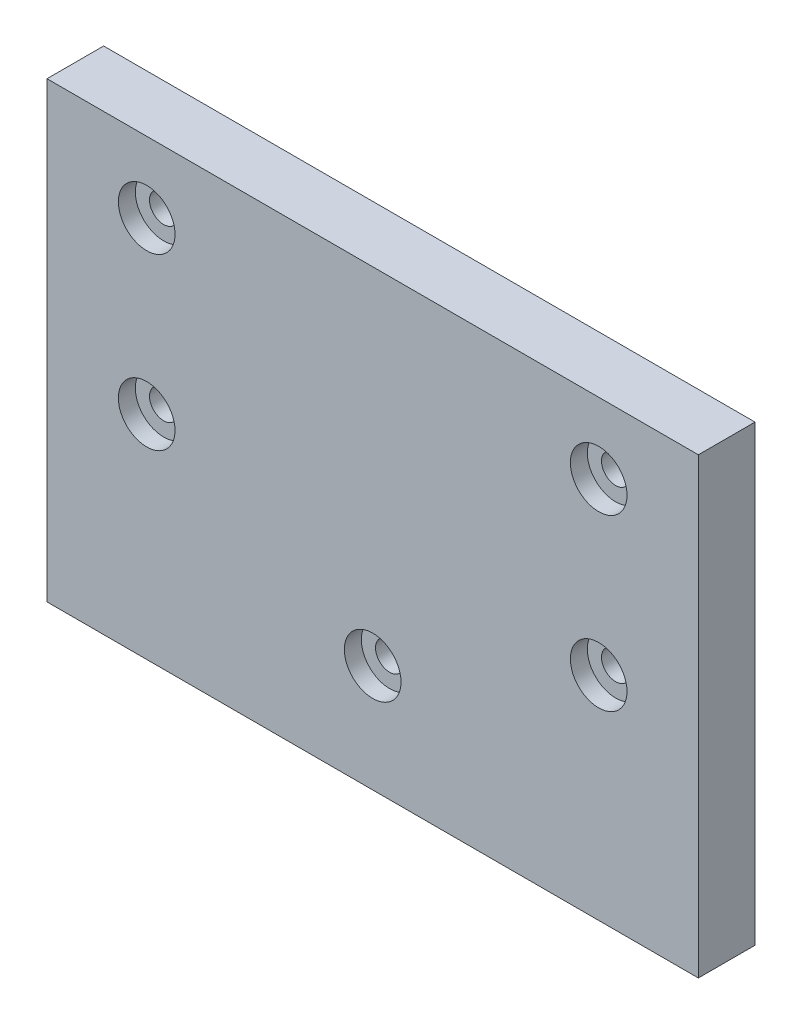
ISO-10303-21;
HEADER;
FILE_DESCRIPTION(('STEP AP214'),'2;1');
FILE_NAME('part.step','',(''),(''),'','','');
FILE_SCHEMA(('AUTOMOTIVE_DESIGN { 1 0 10303 214 1 1 1 1 }'));
ENDSEC;
DATA;
#1=APPLICATION_CONTEXT('core data for automotive mechanical design processes');
#2=APPLICATION_PROTOCOL_DEFINITION('international standard','automotive_design',2000,#1);
#3=PRODUCT_CONTEXT('',#1,'mechanical');
#4=PRODUCT('Part','Part','',(#3));
#5=PRODUCT_RELATED_PRODUCT_CATEGORY('part','',(#4));
#6=PRODUCT_DEFINITION_FORMATION('','',#4);
#7=PRODUCT_DEFINITION_CONTEXT('part definition',#1,'design');
#8=PRODUCT_DEFINITION('design','',#6,#7);
#9=PRODUCT_DEFINITION_SHAPE('','',#8);
#10=(LENGTH_UNIT() NAMED_UNIT(*) SI_UNIT(.MILLI.,.METRE.));
#11=(NAMED_UNIT(*) PLANE_ANGLE_UNIT() SI_UNIT($,.RADIAN.));
#12=(NAMED_UNIT(*) SI_UNIT($,.STERADIAN.) SOLID_ANGLE_UNIT());
#13=UNCERTAINTY_MEASURE_WITH_UNIT(LENGTH_MEASURE(1.E-05),#10,'distance_accuracy_value','');
#14=(GEOMETRIC_REPRESENTATION_CONTEXT(3) GLOBAL_UNCERTAINTY_ASSIGNED_CONTEXT((#13)) GLOBAL_UNIT_ASSIGNED_CONTEXT((#10,
#11,#12)) REPRESENTATION_CONTEXT('',''));
#15=CARTESIAN_POINT('',(0.,0.,0.));
#16=DIRECTION('',(0.,0.,1.));
#17=DIRECTION('',(1.,0.,0.));
#18=AXIS2_PLACEMENT_3D('',#15,#16,#17);
#19=CARTESIAN_POINT('',(0.,-21.009684694307,0.));
#20=DIRECTION('',(0.,0.,1.));
#21=DIRECTION('',(1.,0.,0.));
#22=AXIS2_PLACEMENT_3D('',#19,#20,#21);
#23=CYLINDRICAL_SURFACE('',#22,2.5);
#24=CARTESIAN_POINT('',(0.,-21.009684694307,0.));
#25=DIRECTION('',(0.,0.,1.));
#26=DIRECTION('',(1.,0.,0.));
#27=AXIS2_PLACEMENT_3D('',#24,#25,#26);
#28=CIRCLE('',#27,2.5);
#29=CARTESIAN_POINT('',(2.5,-21.009684694307,0.));
#30=VERTEX_POINT('',#29);
#31=EDGE_CURVE('E216',#30,#30,#28,.T.);
#32=ORIENTED_EDGE('',*,*,#31,.F.);
#33=EDGE_LOOP('',(#32));
#34=FACE_BOUND('',#33,.T.);
#35=CARTESIAN_POINT('',(0.,-21.009684694307,7.));
#36=DIRECTION('',(0.,0.,1.));
#37=DIRECTION('',(1.,0.,0.));
#38=AXIS2_PLACEMENT_3D('',#35,#36,#37);
#39=CIRCLE('',#38,2.5);
#40=CARTESIAN_POINT('',(2.5,-21.009684694307,7.));
#41=VERTEX_POINT('',#40);
#42=EDGE_CURVE('E37',#41,#41,#39,.F.);
#43=ORIENTED_EDGE('',*,*,#42,.F.);
#44=EDGE_LOOP('',(#43));
#45=FACE_BOUND('',#44,.T.);
#46=ADVANCED_FACE('F33',(#34,#45),#23,.F.);
#47=CARTESIAN_POINT('',(39.9,-2.5,0.));
#48=DIRECTION('',(0.,0.,1.));
#49=DIRECTION('',(1.,0.,0.));
#50=AXIS2_PLACEMENT_3D('',#47,#48,#49);
#51=CYLINDRICAL_SURFACE('',#50,2.5);
#52=CARTESIAN_POINT('',(39.9,-2.5,0.));
#53=DIRECTION('',(0.,0.,1.));
#54=DIRECTION('',(1.,0.,0.));
#55=AXIS2_PLACEMENT_3D('',#52,#53,#54);
#56=CIRCLE('',#55,2.5);
#57=CARTESIAN_POINT('',(42.4,-2.5,0.));
#58=VERTEX_POINT('',#57);
#59=EDGE_CURVE('E11',#58,#58,#56,.T.);
#60=ORIENTED_EDGE('',*,*,#59,.F.);
#61=EDGE_LOOP('',(#60));
#62=FACE_BOUND('',#61,.T.);
#63=CARTESIAN_POINT('',(39.9,-2.5,7.));
#64=DIRECTION('',(0.,0.,1.));
#65=DIRECTION('',(1.,0.,0.));
#66=AXIS2_PLACEMENT_3D('',#63,#64,#65);
#67=CIRCLE('',#66,2.5);
#68=CARTESIAN_POINT('',(42.4,-2.5,7.));
#69=VERTEX_POINT('',#68);
#70=EDGE_CURVE('E126',#69,#69,#67,.F.);
#71=ORIENTED_EDGE('',*,*,#70,.F.);
#72=EDGE_LOOP('',(#71));
#73=FACE_BOUND('',#72,.T.);
#74=ADVANCED_FACE('F35',(#62,#73),#51,.F.);
#75=CARTESIAN_POINT('',(-39.9,-2.5,0.));
#76=DIRECTION('',(0.,0.,1.));
#77=DIRECTION('',(1.,0.,0.));
#78=AXIS2_PLACEMENT_3D('',#75,#76,#77);
#79=CYLINDRICAL_SURFACE('',#78,2.5);
#80=CARTESIAN_POINT('',(-39.9,-2.5,0.));
#81=DIRECTION('',(0.,0.,1.));
#82=DIRECTION('',(1.,0.,0.));
#83=AXIS2_PLACEMENT_3D('',#80,#81,#82);
#84=CIRCLE('',#83,2.5);
#85=CARTESIAN_POINT('',(-37.4,-2.5,0.));
#86=VERTEX_POINT('',#85);
#87=EDGE_CURVE('E43',#86,#86,#84,.T.);
#88=ORIENTED_EDGE('',*,*,#87,.F.);
#89=EDGE_LOOP('',(#88));
#90=FACE_BOUND('',#89,.T.);
#91=CARTESIAN_POINT('',(-39.9,-2.5,7.));
#92=DIRECTION('',(0.,0.,1.));
#93=DIRECTION('',(1.,0.,0.));
#94=AXIS2_PLACEMENT_3D('',#91,#92,#93);
#95=CIRCLE('',#94,2.5);
#96=CARTESIAN_POINT('',(-37.4,-2.5,7.));
#97=VERTEX_POINT('',#96);
#98=EDGE_CURVE('E123',#97,#97,#95,.F.);
#99=ORIENTED_EDGE('',*,*,#98,.F.);
#100=EDGE_LOOP('',(#99));
#101=FACE_BOUND('',#100,.T.);
#102=ADVANCED_FACE('F176',(#90,#101),#79,.F.);
#103=CARTESIAN_POINT('',(39.9,27.5,0.));
#104=DIRECTION('',(0.,0.,1.));
#105=DIRECTION('',(1.,0.,0.));
#106=AXIS2_PLACEMENT_3D('',#103,#104,#105);
#107=CYLINDRICAL_SURFACE('',#106,2.5);
#108=CARTESIAN_POINT('',(39.9,27.5,0.));
#109=DIRECTION('',(0.,0.,1.));
#110=DIRECTION('',(1.,0.,0.));
#111=AXIS2_PLACEMENT_3D('',#108,#109,#110);
#112=CIRCLE('',#111,2.5);
#113=CARTESIAN_POINT('',(42.4,27.5,0.));
#114=VERTEX_POINT('',#113);
#115=EDGE_CURVE('E118',#114,#114,#112,.T.);
#116=ORIENTED_EDGE('',*,*,#115,.F.);
#117=EDGE_LOOP('',(#116));
#118=FACE_BOUND('',#117,.T.);
#119=CARTESIAN_POINT('',(39.9,27.5,7.));
#120=DIRECTION('',(0.,0.,1.));
#121=DIRECTION('',(1.,0.,0.));
#122=AXIS2_PLACEMENT_3D('',#119,#120,#121);
#123=CIRCLE('',#122,2.5);
#124=CARTESIAN_POINT('',(42.4,27.5,7.));
#125=VERTEX_POINT('',#124);
#126=EDGE_CURVE('E120',#125,#125,#123,.F.);
#127=ORIENTED_EDGE('',*,*,#126,.F.);
#128=EDGE_LOOP('',(#127));
#129=FACE_BOUND('',#128,.T.);
#130=ADVANCED_FACE('F151',(#118,#129),#107,.F.);
#131=CARTESIAN_POINT('',(-39.9,27.5,0.));
#132=DIRECTION('',(0.,0.,1.));
#133=DIRECTION('',(1.,0.,0.));
#134=AXIS2_PLACEMENT_3D('',#131,#132,#133);
#135=CYLINDRICAL_SURFACE('',#134,2.5);
#136=CARTESIAN_POINT('',(-39.9,27.5,0.));
#137=DIRECTION('',(0.,0.,1.));
#138=DIRECTION('',(1.,0.,0.));
#139=AXIS2_PLACEMENT_3D('',#136,#137,#138);
#140=CIRCLE('',#139,2.5);
#141=CARTESIAN_POINT('',(-37.4,27.5,0.));
#142=VERTEX_POINT('',#141);
#143=EDGE_CURVE('E106',#142,#142,#140,.T.);
#144=ORIENTED_EDGE('',*,*,#143,.F.);
#145=EDGE_LOOP('',(#144));
#146=FACE_BOUND('',#145,.T.);
#147=CARTESIAN_POINT('',(-39.9,27.5,7.));
#148=DIRECTION('',(0.,0.,1.));
#149=DIRECTION('',(1.,0.,0.));
#150=AXIS2_PLACEMENT_3D('',#147,#148,#149);
#151=CIRCLE('',#150,2.5);
#152=CARTESIAN_POINT('',(-37.4,27.5,7.));
#153=VERTEX_POINT('',#152);
#154=EDGE_CURVE('E115',#153,#153,#151,.F.);
#155=ORIENTED_EDGE('',*,*,#154,.F.);
#156=EDGE_LOOP('',(#155));
#157=FACE_BOUND('',#156,.T.);
#158=ADVANCED_FACE('F147',(#146,#157),#135,.F.);
#159=CARTESIAN_POINT('',(57.5,40.,10.));
#160=DIRECTION('',(-1.,0.,0.));
#161=DIRECTION('',(0.,-1.,0.));
#162=AXIS2_PLACEMENT_3D('',#159,#160,#161);
#163=PLANE('',#162);
#164=DIRECTION('',(0.,1.,0.));
#165=VECTOR('',#164,1.);
#166=CARTESIAN_POINT('',(57.5,40.,0.));
#167=LINE('',#166,#165);
#168=CARTESIAN_POINT('',(57.5,-40.,0.));
#169=VERTEX_POINT('',#168);
#170=CARTESIAN_POINT('',(57.5,40.,0.));
#171=VERTEX_POINT('',#170);
#172=EDGE_CURVE('E103',#169,#171,#167,.T.);
#173=ORIENTED_EDGE('',*,*,#172,.T.);
#174=DIRECTION('',(0.,0.,-1.));
#175=VECTOR('',#174,1.);
#176=CARTESIAN_POINT('',(57.5,40.,10.));
#177=LINE('',#176,#175);
#178=CARTESIAN_POINT('',(57.5,40.,10.));
#179=VERTEX_POINT('',#178);
#180=EDGE_CURVE('E94',#179,#171,#177,.T.);
#181=ORIENTED_EDGE('',*,*,#180,.F.);
#182=DIRECTION('',(0.,1.,0.));
#183=VECTOR('',#182,1.);
#184=CARTESIAN_POINT('',(57.5,40.,10.));
#185=LINE('',#184,#183);
#186=CARTESIAN_POINT('',(57.5,-40.,10.));
#187=VERTEX_POINT('',#186);
#188=EDGE_CURVE('E88',#187,#179,#185,.T.);
#189=ORIENTED_EDGE('',*,*,#188,.F.);
#190=DIRECTION('',(0.,0.,-1.));
#191=VECTOR('',#190,1.);
#192=CARTESIAN_POINT('',(57.5,-40.,10.));
#193=LINE('',#192,#191);
#194=EDGE_CURVE('E99',#187,#169,#193,.T.);
#195=ORIENTED_EDGE('',*,*,#194,.T.);
#196=EDGE_LOOP('',(#173,#181,#189,#195));
#197=FACE_BOUND('',#196,.T.);
#198=ADVANCED_FACE('F150',(#197),#163,.F.);
#199=CARTESIAN_POINT('',(-57.5,40.,10.));
#200=DIRECTION('',(0.,-1.,0.));
#201=DIRECTION('',(0.,0.,-1.));
#202=AXIS2_PLACEMENT_3D('',#199,#200,#201);
#203=PLANE('',#202);
#204=DIRECTION('',(-1.,0.,0.));
#205=VECTOR('',#204,1.);
#206=CARTESIAN_POINT('',(-57.5,40.,0.));
#207=LINE('',#206,#205);
#208=CARTESIAN_POINT('',(-57.5,40.,0.));
#209=VERTEX_POINT('',#208);
#210=EDGE_CURVE('E93',#171,#209,#207,.T.);
#211=ORIENTED_EDGE('',*,*,#210,.T.);
#212=DIRECTION('',(0.,0.,-1.));
#213=VECTOR('',#212,1.);
#214=CARTESIAN_POINT('',(-57.5,40.,10.));
#215=LINE('',#214,#213);
#216=CARTESIAN_POINT('',(-57.5,40.,10.));
#217=VERTEX_POINT('',#216);
#218=EDGE_CURVE('E91',#217,#209,#215,.T.);
#219=ORIENTED_EDGE('',*,*,#218,.F.);
#220=DIRECTION('',(-1.,0.,0.));
#221=VECTOR('',#220,1.);
#222=CARTESIAN_POINT('',(-57.5,40.,10.));
#223=LINE('',#222,#221);
#224=EDGE_CURVE('E83',#179,#217,#223,.T.);
#225=ORIENTED_EDGE('',*,*,#224,.F.);
#226=ORIENTED_EDGE('',*,*,#180,.T.);
#227=EDGE_LOOP('',(#211,#219,#225,#226));
#228=FACE_BOUND('',#227,.T.);
#229=ADVANCED_FACE('F92',(#228),#203,.F.);
#230=CARTESIAN_POINT('',(-57.5,40.,10.));
#231=DIRECTION('',(1.,0.,0.));
#232=DIRECTION('',(0.,1.,0.));
#233=AXIS2_PLACEMENT_3D('',#230,#231,#232);
#234=PLANE('',#233);
#235=DIRECTION('',(0.,-1.,0.));
#236=VECTOR('',#235,1.);
#237=CARTESIAN_POINT('',(-57.5,40.,0.));
#238=LINE('',#237,#236);
#239=CARTESIAN_POINT('',(-57.5,-40.,0.));
#240=VERTEX_POINT('',#239);
#241=EDGE_CURVE('E69',#209,#240,#238,.T.);
#242=ORIENTED_EDGE('',*,*,#241,.T.);
#243=DIRECTION('',(0.,0.,-1.));
#244=VECTOR('',#243,1.);
#245=CARTESIAN_POINT('',(-57.5,-40.,10.));
#246=LINE('',#245,#244);
#247=CARTESIAN_POINT('',(-57.5,-40.,10.));
#248=VERTEX_POINT('',#247);
#249=EDGE_CURVE('E95',#248,#240,#246,.T.);
#250=ORIENTED_EDGE('',*,*,#249,.F.);
#251=DIRECTION('',(0.,-1.,0.));
#252=VECTOR('',#251,1.);
#253=CARTESIAN_POINT('',(-57.5,40.,10.));
#254=LINE('',#253,#252);
#255=EDGE_CURVE('E86',#217,#248,#254,.T.);
#256=ORIENTED_EDGE('',*,*,#255,.F.);
#257=ORIENTED_EDGE('',*,*,#218,.T.);
#258=EDGE_LOOP('',(#242,#250,#256,#257));
#259=FACE_BOUND('',#258,.T.);
#260=ADVANCED_FACE('F97',(#259),#234,.F.);
#261=CARTESIAN_POINT('',(-57.5,-40.,10.));
#262=DIRECTION('',(0.,1.,0.));
#263=DIRECTION('',(0.,0.,1.));
#264=AXIS2_PLACEMENT_3D('',#261,#262,#263);
#265=PLANE('',#264);
#266=DIRECTION('',(1.,0.,0.));
#267=VECTOR('',#266,1.);
#268=CARTESIAN_POINT('',(-57.5,-40.,0.));
#269=LINE('',#268,#267);
#270=EDGE_CURVE('E75',#240,#169,#269,.T.);
#271=ORIENTED_EDGE('',*,*,#270,.T.);
#272=ORIENTED_EDGE('',*,*,#194,.F.);
#273=DIRECTION('',(1.,0.,0.));
#274=VECTOR('',#273,1.);
#275=CARTESIAN_POINT('',(-57.5,-40.,10.));
#276=LINE('',#275,#274);
#277=EDGE_CURVE('E52',#248,#187,#276,.T.);
#278=ORIENTED_EDGE('',*,*,#277,.F.);
#279=ORIENTED_EDGE('',*,*,#249,.T.);
#280=EDGE_LOOP('',(#271,#272,#278,#279));
#281=FACE_BOUND('',#280,.T.);
#282=ADVANCED_FACE('F254',(#281),#265,.F.);
#283=CARTESIAN_POINT('',(0.,0.,10.));
#284=DIRECTION('',(0.,0.,1.));
#285=DIRECTION('',(1.,0.,0.));
#286=AXIS2_PLACEMENT_3D('',#283,#284,#285);
#287=PLANE('',#286);
#288=CARTESIAN_POINT('',(0.,-21.009684694307,10.));
#289=DIRECTION('',(0.,0.,1.));
#290=DIRECTION('',(1.,0.,0.));
#291=AXIS2_PLACEMENT_3D('',#288,#289,#290);
#292=CIRCLE('',#291,5.);
#293=CARTESIAN_POINT('',(5.,-21.009684694307,10.));
#294=VERTEX_POINT('',#293);
#295=EDGE_CURVE('E232',#294,#294,#292,.T.);
#296=ORIENTED_EDGE('',*,*,#295,.F.);
#297=EDGE_LOOP('',(#296));
#298=FACE_BOUND('',#297,.T.);
#299=CARTESIAN_POINT('',(-39.9,-2.5,10.));
#300=DIRECTION('',(0.,0.,1.));
#301=DIRECTION('',(1.,0.,0.));
#302=AXIS2_PLACEMENT_3D('',#299,#300,#301);
#303=CIRCLE('',#302,5.);
#304=CARTESIAN_POINT('',(-34.9,-2.5,10.));
#305=VERTEX_POINT('',#304);
#306=EDGE_CURVE('E227',#305,#305,#303,.T.);
#307=ORIENTED_EDGE('',*,*,#306,.F.);
#308=EDGE_LOOP('',(#307));
#309=FACE_BOUND('',#308,.T.);
#310=CARTESIAN_POINT('',(39.9,27.5,10.));
#311=DIRECTION('',(0.,0.,1.));
#312=DIRECTION('',(1.,0.,0.));
#313=AXIS2_PLACEMENT_3D('',#310,#311,#312);
#314=CIRCLE('',#313,5.);
#315=CARTESIAN_POINT('',(44.9,27.5,10.));
#316=VERTEX_POINT('',#315);
#317=EDGE_CURVE('E217',#316,#316,#314,.T.);
#318=ORIENTED_EDGE('',*,*,#317,.F.);
#319=EDGE_LOOP('',(#318));
#320=FACE_BOUND('',#319,.T.);
#321=CARTESIAN_POINT('',(39.9,-2.5,10.));
#322=DIRECTION('',(0.,0.,1.));
#323=DIRECTION('',(1.,0.,0.));
#324=AXIS2_PLACEMENT_3D('',#321,#322,#323);
#325=CIRCLE('',#324,5.);
#326=CARTESIAN_POINT('',(44.9,-2.5,10.));
#327=VERTEX_POINT('',#326);
#328=EDGE_CURVE('E214',#327,#327,#325,.T.);
#329=ORIENTED_EDGE('',*,*,#328,.F.);
#330=EDGE_LOOP('',(#329));
#331=FACE_BOUND('',#330,.T.);
#332=CARTESIAN_POINT('',(-39.9,27.5,10.));
#333=DIRECTION('',(0.,0.,1.));
#334=DIRECTION('',(1.,0.,0.));
#335=AXIS2_PLACEMENT_3D('',#332,#333,#334);
#336=CIRCLE('',#335,5.);
#337=CARTESIAN_POINT('',(-34.9,27.5,10.));
#338=VERTEX_POINT('',#337);
#339=EDGE_CURVE('E128',#338,#338,#336,.T.);
#340=ORIENTED_EDGE('',*,*,#339,.F.);
#341=EDGE_LOOP('',(#340));
#342=FACE_BOUND('',#341,.T.);
#343=ORIENTED_EDGE('',*,*,#188,.T.);
#344=ORIENTED_EDGE('',*,*,#224,.T.);
#345=ORIENTED_EDGE('',*,*,#255,.T.);
#346=ORIENTED_EDGE('',*,*,#277,.T.);
#347=EDGE_LOOP('',(#343,#344,#345,#346));
#348=FACE_BOUND('',#347,.T.);
#349=ADVANCED_FACE('F84',(#298,#309,#320,#331,#342,#348),#287,.T.);
#350=CARTESIAN_POINT('',(0.,0.,0.));
#351=DIRECTION('',(0.,0.,1.));
#352=DIRECTION('',(1.,0.,0.));
#353=AXIS2_PLACEMENT_3D('',#350,#351,#352);
#354=PLANE('',#353);
#355=ORIENTED_EDGE('',*,*,#31,.T.);
#356=EDGE_LOOP('',(#355));
#357=FACE_BOUND('',#356,.T.);
#358=ORIENTED_EDGE('',*,*,#115,.T.);
#359=EDGE_LOOP('',(#358));
#360=FACE_BOUND('',#359,.T.);
#361=ORIENTED_EDGE('',*,*,#143,.T.);
#362=EDGE_LOOP('',(#361));
#363=FACE_BOUND('',#362,.T.);
#364=ORIENTED_EDGE('',*,*,#172,.F.);
#365=ORIENTED_EDGE('',*,*,#270,.F.);
#366=ORIENTED_EDGE('',*,*,#241,.F.);
#367=ORIENTED_EDGE('',*,*,#210,.F.);
#368=EDGE_LOOP('',(#364,#365,#366,#367));
#369=FACE_BOUND('',#368,.T.);
#370=ORIENTED_EDGE('',*,*,#87,.T.);
#371=EDGE_LOOP('',(#370));
#372=FACE_BOUND('',#371,.T.);
#373=ORIENTED_EDGE('',*,*,#59,.T.);
#374=EDGE_LOOP('',(#373));
#375=FACE_BOUND('',#374,.T.);
#376=ADVANCED_FACE('F144',(#357,#360,#363,#369,#372,#375),#354,.F.);
#377=CARTESIAN_POINT('',(-39.9,27.5,7.));
#378=DIRECTION('',(0.,0.,1.));
#379=DIRECTION('',(1.,0.,0.));
#380=AXIS2_PLACEMENT_3D('',#377,#378,#379);
#381=PLANE('',#380);
#382=CARTESIAN_POINT('',(-39.9,27.5,7.));
#383=DIRECTION('',(0.,0.,1.));
#384=DIRECTION('',(1.,0.,0.));
#385=AXIS2_PLACEMENT_3D('',#382,#383,#384);
#386=CIRCLE('',#385,5.);
#387=CARTESIAN_POINT('',(-34.9,27.5,7.));
#388=VERTEX_POINT('',#387);
#389=EDGE_CURVE('E119',#388,#388,#386,.T.);
#390=ORIENTED_EDGE('',*,*,#389,.T.);
#391=EDGE_LOOP('',(#390));
#392=FACE_BOUND('',#391,.T.);
#393=ORIENTED_EDGE('',*,*,#154,.T.);
#394=EDGE_LOOP('',(#393));
#395=FACE_BOUND('',#394,.T.);
#396=ADVANCED_FACE('F155',(#392,#395),#381,.T.);
#397=CARTESIAN_POINT('',(-39.9,27.5,7.));
#398=DIRECTION('',(0.,0.,1.));
#399=DIRECTION('',(1.,0.,0.));
#400=AXIS2_PLACEMENT_3D('',#397,#398,#399);
#401=CYLINDRICAL_SURFACE('',#400,5.);
#402=ORIENTED_EDGE('',*,*,#389,.F.);
#403=EDGE_LOOP('',(#402));
#404=FACE_BOUND('',#403,.T.);
#405=ORIENTED_EDGE('',*,*,#339,.T.);
#406=EDGE_LOOP('',(#405));
#407=FACE_BOUND('',#406,.T.);
#408=ADVANCED_FACE('F157',(#404,#407),#401,.F.);
#409=CARTESIAN_POINT('',(39.9,27.5,7.));
#410=DIRECTION('',(0.,0.,1.));
#411=DIRECTION('',(1.,0.,0.));
#412=AXIS2_PLACEMENT_3D('',#409,#410,#411);
#413=PLANE('',#412);
#414=CARTESIAN_POINT('',(39.9,27.5,7.));
#415=DIRECTION('',(0.,0.,1.));
#416=DIRECTION('',(1.,0.,0.));
#417=AXIS2_PLACEMENT_3D('',#414,#415,#416);
#418=CIRCLE('',#417,5.);
#419=CARTESIAN_POINT('',(44.9,27.5,7.));
#420=VERTEX_POINT('',#419);
#421=EDGE_CURVE('E224',#420,#420,#418,.T.);
#422=ORIENTED_EDGE('',*,*,#421,.T.);
#423=EDGE_LOOP('',(#422));
#424=FACE_BOUND('',#423,.T.);
#425=ORIENTED_EDGE('',*,*,#126,.T.);
#426=EDGE_LOOP('',(#425));
#427=FACE_BOUND('',#426,.T.);
#428=ADVANCED_FACE('F164',(#424,#427),#413,.T.);
#429=CARTESIAN_POINT('',(39.9,27.5,7.));
#430=DIRECTION('',(0.,0.,1.));
#431=DIRECTION('',(1.,0.,0.));
#432=AXIS2_PLACEMENT_3D('',#429,#430,#431);
#433=CYLINDRICAL_SURFACE('',#432,5.);
#434=ORIENTED_EDGE('',*,*,#421,.F.);
#435=EDGE_LOOP('',(#434));
#436=FACE_BOUND('',#435,.T.);
#437=ORIENTED_EDGE('',*,*,#317,.T.);
#438=EDGE_LOOP('',(#437));
#439=FACE_BOUND('',#438,.T.);
#440=ADVANCED_FACE('F196',(#436,#439),#433,.F.);
#441=CARTESIAN_POINT('',(39.9,-2.5,7.));
#442=DIRECTION('',(0.,0.,1.));
#443=DIRECTION('',(1.,0.,0.));
#444=AXIS2_PLACEMENT_3D('',#441,#442,#443);
#445=PLANE('',#444);
#446=CARTESIAN_POINT('',(39.9,-2.5,7.));
#447=DIRECTION('',(0.,0.,1.));
#448=DIRECTION('',(1.,0.,0.));
#449=AXIS2_PLACEMENT_3D('',#446,#447,#448);
#450=CIRCLE('',#449,5.);
#451=CARTESIAN_POINT('',(44.9,-2.5,7.));
#452=VERTEX_POINT('',#451);
#453=EDGE_CURVE('E211',#452,#452,#450,.T.);
#454=ORIENTED_EDGE('',*,*,#453,.T.);
#455=EDGE_LOOP('',(#454));
#456=FACE_BOUND('',#455,.T.);
#457=ORIENTED_EDGE('',*,*,#70,.T.);
#458=EDGE_LOOP('',(#457));
#459=FACE_BOUND('',#458,.T.);
#460=ADVANCED_FACE('F200',(#456,#459),#445,.T.);
#461=CARTESIAN_POINT('',(39.9,-2.5,7.));
#462=DIRECTION('',(0.,0.,1.));
#463=DIRECTION('',(1.,0.,0.));
#464=AXIS2_PLACEMENT_3D('',#461,#462,#463);
#465=CYLINDRICAL_SURFACE('',#464,5.);
#466=ORIENTED_EDGE('',*,*,#453,.F.);
#467=EDGE_LOOP('',(#466));
#468=FACE_BOUND('',#467,.T.);
#469=ORIENTED_EDGE('',*,*,#328,.T.);
#470=EDGE_LOOP('',(#469));
#471=FACE_BOUND('',#470,.T.);
#472=ADVANCED_FACE('F188',(#468,#471),#465,.F.);
#473=CARTESIAN_POINT('',(-39.9,-2.5,7.));
#474=DIRECTION('',(0.,0.,1.));
#475=DIRECTION('',(1.,0.,0.));
#476=AXIS2_PLACEMENT_3D('',#473,#474,#475);
#477=PLANE('',#476);
#478=CARTESIAN_POINT('',(-39.9,-2.5,7.));
#479=DIRECTION('',(0.,0.,1.));
#480=DIRECTION('',(1.,0.,0.));
#481=AXIS2_PLACEMENT_3D('',#478,#479,#480);
#482=CIRCLE('',#481,5.);
#483=CARTESIAN_POINT('',(-34.9,-2.5,7.));
#484=VERTEX_POINT('',#483);
#485=EDGE_CURVE('E124',#484,#484,#482,.T.);
#486=ORIENTED_EDGE('',*,*,#485,.T.);
#487=EDGE_LOOP('',(#486));
#488=FACE_BOUND('',#487,.T.);
#489=ORIENTED_EDGE('',*,*,#98,.T.);
#490=EDGE_LOOP('',(#489));
#491=FACE_BOUND('',#490,.T.);
#492=ADVANCED_FACE('F184',(#488,#491),#477,.T.);
#493=CARTESIAN_POINT('',(-39.9,-2.5,7.));
#494=DIRECTION('',(0.,0.,1.));
#495=DIRECTION('',(1.,0.,0.));
#496=AXIS2_PLACEMENT_3D('',#493,#494,#495);
#497=CYLINDRICAL_SURFACE('',#496,5.);
#498=ORIENTED_EDGE('',*,*,#485,.F.);
#499=EDGE_LOOP('',(#498));
#500=FACE_BOUND('',#499,.T.);
#501=ORIENTED_EDGE('',*,*,#306,.T.);
#502=EDGE_LOOP('',(#501));
#503=FACE_BOUND('',#502,.T.);
#504=ADVANCED_FACE('F187',(#500,#503),#497,.F.);
#505=CARTESIAN_POINT('',(0.,-21.009684694307,7.));
#506=DIRECTION('',(0.,0.,1.));
#507=DIRECTION('',(1.,0.,0.));
#508=AXIS2_PLACEMENT_3D('',#505,#506,#507);
#509=PLANE('',#508);
#510=CARTESIAN_POINT('',(0.,-21.009684694307,7.));
#511=DIRECTION('',(0.,0.,1.));
#512=DIRECTION('',(1.,0.,0.));
#513=AXIS2_PLACEMENT_3D('',#510,#511,#512);
#514=CIRCLE('',#513,5.);
#515=CARTESIAN_POINT('',(5.,-21.009684694307,7.));
#516=VERTEX_POINT('',#515);
#517=EDGE_CURVE('E235',#516,#516,#514,.T.);
#518=ORIENTED_EDGE('',*,*,#517,.T.);
#519=EDGE_LOOP('',(#518));
#520=FACE_BOUND('',#519,.T.);
#521=ORIENTED_EDGE('',*,*,#42,.T.);
#522=EDGE_LOOP('',(#521));
#523=FACE_BOUND('',#522,.T.);
#524=ADVANCED_FACE('F192',(#520,#523),#509,.T.);
#525=CARTESIAN_POINT('',(0.,-21.009684694307,7.));
#526=DIRECTION('',(0.,0.,1.));
#527=DIRECTION('',(1.,0.,0.));
#528=AXIS2_PLACEMENT_3D('',#525,#526,#527);
#529=CYLINDRICAL_SURFACE('',#528,5.);
#530=ORIENTED_EDGE('',*,*,#517,.F.);
#531=EDGE_LOOP('',(#530));
#532=FACE_BOUND('',#531,.T.);
#533=ORIENTED_EDGE('',*,*,#295,.T.);
#534=EDGE_LOOP('',(#533));
#535=FACE_BOUND('',#534,.T.);
#536=ADVANCED_FACE('F182',(#532,#535),#529,.F.);
#537=CLOSED_SHELL('',(#46,#74,#102,#130,#158,#198,#229,#260,#282,#349,#376,#396,#408,#428,#440,
#460,#472,#492,#504,#524,#536));
#538=MANIFOLD_SOLID_BREP('B2',#537);
#539=ADVANCED_BREP_SHAPE_REPRESENTATION('',(#18,#538),#14);
#540=SHAPE_DEFINITION_REPRESENTATION(#9,#539);
ENDSEC;
END-ISO-10303-21;
